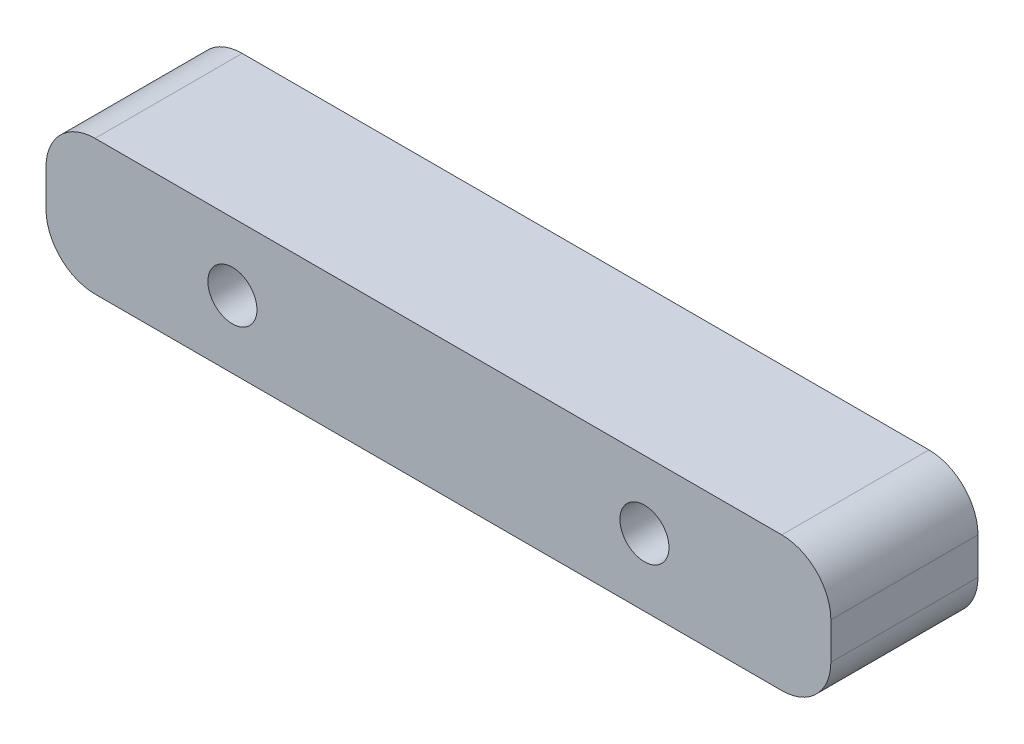
ISO-10303-21;
HEADER;
FILE_DESCRIPTION(('STEP AP214'),'2;1');
FILE_NAME('part.step','',(''),(''),'','','');
FILE_SCHEMA(('AUTOMOTIVE_DESIGN { 1 0 10303 214 1 1 1 1 }'));
ENDSEC;
DATA;
#1=APPLICATION_CONTEXT('core data for automotive mechanical design processes');
#2=APPLICATION_PROTOCOL_DEFINITION('international standard','automotive_design',2000,#1);
#3=PRODUCT_CONTEXT('',#1,'mechanical');
#4=PRODUCT('Part','Part','',(#3));
#5=PRODUCT_RELATED_PRODUCT_CATEGORY('part','',(#4));
#6=PRODUCT_DEFINITION_FORMATION('','',#4);
#7=PRODUCT_DEFINITION_CONTEXT('part definition',#1,'design');
#8=PRODUCT_DEFINITION('design','',#6,#7);
#9=PRODUCT_DEFINITION_SHAPE('','',#8);
#10=(LENGTH_UNIT() NAMED_UNIT(*) SI_UNIT(.MILLI.,.METRE.));
#11=(NAMED_UNIT(*) PLANE_ANGLE_UNIT() SI_UNIT($,.RADIAN.));
#12=(NAMED_UNIT(*) SI_UNIT($,.STERADIAN.) SOLID_ANGLE_UNIT());
#13=UNCERTAINTY_MEASURE_WITH_UNIT(LENGTH_MEASURE(1.E-05),#10,'distance_accuracy_value','');
#14=(GEOMETRIC_REPRESENTATION_CONTEXT(3) GLOBAL_UNCERTAINTY_ASSIGNED_CONTEXT((#13)) GLOBAL_UNIT_ASSIGNED_CONTEXT((#10,
#11,#12)) REPRESENTATION_CONTEXT('',''));
#15=CARTESIAN_POINT('',(0.,0.,0.));
#16=DIRECTION('',(0.,0.,1.));
#17=DIRECTION('',(1.,0.,0.));
#18=AXIS2_PLACEMENT_3D('',#15,#16,#17);
#19=CARTESIAN_POINT('',(35.,-1.875,15.));
#20=DIRECTION('',(0.,0.,-1.));
#21=DIRECTION('',(-1.,0.,0.));
#22=AXIS2_PLACEMENT_3D('',#19,#20,#21);
#23=CYLINDRICAL_SURFACE('',#22,4.99999999999999);
#24=CARTESIAN_POINT('',(35.,-1.875,0.));
#25=DIRECTION('',(0.,0.,1.));
#26=DIRECTION('',(1.,0.,0.));
#27=AXIS2_PLACEMENT_3D('',#24,#25,#26);
#28=CIRCLE('',#27,4.99999999999999);
#29=CARTESIAN_POINT('',(35.,-6.875,0.));
#30=VERTEX_POINT('',#29);
#31=CARTESIAN_POINT('',(40.,-1.875,0.));
#32=VERTEX_POINT('',#31);
#33=EDGE_CURVE('E139',#30,#32,#28,.T.);
#34=ORIENTED_EDGE('',*,*,#33,.T.);
#35=DIRECTION('',(0.,0.,-1.));
#36=VECTOR('',#35,1.);
#37=CARTESIAN_POINT('',(40.,-1.875,15.));
#38=LINE('',#37,#36);
#39=CARTESIAN_POINT('',(40.,-1.875,15.));
#40=VERTEX_POINT('',#39);
#41=EDGE_CURVE('E11',#40,#32,#38,.T.);
#42=ORIENTED_EDGE('',*,*,#41,.F.);
#43=CARTESIAN_POINT('',(35.,-1.875,15.));
#44=DIRECTION('',(0.,0.,1.));
#45=DIRECTION('',(1.,0.,0.));
#46=AXIS2_PLACEMENT_3D('',#43,#44,#45);
#47=CIRCLE('',#46,4.99999999999999);
#48=CARTESIAN_POINT('',(35.,-6.875,15.));
#49=VERTEX_POINT('',#48);
#50=EDGE_CURVE('E154',#49,#40,#47,.T.);
#51=ORIENTED_EDGE('',*,*,#50,.F.);
#52=DIRECTION('',(0.,0.,-1.));
#53=VECTOR('',#52,1.);
#54=CARTESIAN_POINT('',(35.,-6.875,15.));
#55=LINE('',#54,#53);
#56=EDGE_CURVE('E135',#49,#30,#55,.T.);
#57=ORIENTED_EDGE('',*,*,#56,.T.);
#58=EDGE_LOOP('',(#34,#42,#51,#57));
#59=FACE_BOUND('',#58,.T.);
#60=ADVANCED_FACE('F43',(#59),#23,.T.);
#61=CARTESIAN_POINT('',(40.,1.875,15.));
#62=DIRECTION('',(-1.,0.,0.));
#63=DIRECTION('',(0.,0.,1.));
#64=AXIS2_PLACEMENT_3D('',#61,#62,#63);
#65=PLANE('',#64);
#66=DIRECTION('',(0.,1.,0.));
#67=VECTOR('',#66,1.);
#68=CARTESIAN_POINT('',(40.,1.875,0.));
#69=LINE('',#68,#67);
#70=CARTESIAN_POINT('',(40.,1.875,0.));
#71=VERTEX_POINT('',#70);
#72=EDGE_CURVE('E142',#32,#71,#69,.T.);
#73=ORIENTED_EDGE('',*,*,#72,.T.);
#74=DIRECTION('',(0.,0.,-1.));
#75=VECTOR('',#74,1.);
#76=CARTESIAN_POINT('',(40.,1.875,15.));
#77=LINE('',#76,#75);
#78=CARTESIAN_POINT('',(40.,1.875,15.));
#79=VERTEX_POINT('',#78);
#80=EDGE_CURVE('E51',#79,#71,#77,.T.);
#81=ORIENTED_EDGE('',*,*,#80,.F.);
#82=DIRECTION('',(0.,1.,0.));
#83=VECTOR('',#82,1.);
#84=CARTESIAN_POINT('',(40.,1.875,15.));
#85=LINE('',#84,#83);
#86=EDGE_CURVE('E102',#40,#79,#85,.T.);
#87=ORIENTED_EDGE('',*,*,#86,.F.);
#88=ORIENTED_EDGE('',*,*,#41,.T.);
#89=EDGE_LOOP('',(#73,#81,#87,#88));
#90=FACE_BOUND('',#89,.T.);
#91=ADVANCED_FACE('F223',(#90),#65,.F.);
#92=CARTESIAN_POINT('',(35.,1.875,15.));
#93=DIRECTION('',(0.,0.,-1.));
#94=DIRECTION('',(-1.,0.,0.));
#95=AXIS2_PLACEMENT_3D('',#92,#93,#94);
#96=CYLINDRICAL_SURFACE('',#95,5.);
#97=CARTESIAN_POINT('',(35.,1.875,0.));
#98=DIRECTION('',(0.,0.,1.));
#99=DIRECTION('',(1.,0.,0.));
#100=AXIS2_PLACEMENT_3D('',#97,#98,#99);
#101=CIRCLE('',#100,5.);
#102=CARTESIAN_POINT('',(35.,6.875,0.));
#103=VERTEX_POINT('',#102);
#104=EDGE_CURVE('E145',#71,#103,#101,.T.);
#105=ORIENTED_EDGE('',*,*,#104,.T.);
#106=DIRECTION('',(0.,0.,-1.));
#107=VECTOR('',#106,1.);
#108=CARTESIAN_POINT('',(35.,6.875,15.));
#109=LINE('',#108,#107);
#110=CARTESIAN_POINT('',(35.,6.875,15.));
#111=VERTEX_POINT('',#110);
#112=EDGE_CURVE('E161',#111,#103,#109,.T.);
#113=ORIENTED_EDGE('',*,*,#112,.F.);
#114=CARTESIAN_POINT('',(35.,1.875,15.));
#115=DIRECTION('',(0.,0.,1.));
#116=DIRECTION('',(1.,0.,0.));
#117=AXIS2_PLACEMENT_3D('',#114,#115,#116);
#118=CIRCLE('',#117,5.);
#119=EDGE_CURVE('E169',#79,#111,#118,.T.);
#120=ORIENTED_EDGE('',*,*,#119,.F.);
#121=ORIENTED_EDGE('',*,*,#80,.T.);
#122=EDGE_LOOP('',(#105,#113,#120,#121));
#123=FACE_BOUND('',#122,.T.);
#124=ADVANCED_FACE('F167',(#123),#96,.T.);
#125=CARTESIAN_POINT('',(-35.,6.875,15.));
#126=DIRECTION('',(0.,-1.,0.));
#127=DIRECTION('',(0.,0.,-1.));
#128=AXIS2_PLACEMENT_3D('',#125,#126,#127);
#129=PLANE('',#128);
#130=DIRECTION('',(-1.,0.,0.));
#131=VECTOR('',#130,1.);
#132=CARTESIAN_POINT('',(-35.,6.875,0.));
#133=LINE('',#132,#131);
#134=CARTESIAN_POINT('',(-35.,6.875,0.));
#135=VERTEX_POINT('',#134);
#136=EDGE_CURVE('E147',#103,#135,#133,.T.);
#137=ORIENTED_EDGE('',*,*,#136,.T.);
#138=DIRECTION('',(0.,0.,-1.));
#139=VECTOR('',#138,1.);
#140=CARTESIAN_POINT('',(-35.,6.875,15.));
#141=LINE('',#140,#139);
#142=CARTESIAN_POINT('',(-35.,6.875,15.));
#143=VERTEX_POINT('',#142);
#144=EDGE_CURVE('E158',#143,#135,#141,.T.);
#145=ORIENTED_EDGE('',*,*,#144,.F.);
#146=DIRECTION('',(-1.,0.,0.));
#147=VECTOR('',#146,1.);
#148=CARTESIAN_POINT('',(-35.,6.875,15.));
#149=LINE('',#148,#147);
#150=EDGE_CURVE('E181',#111,#143,#149,.T.);
#151=ORIENTED_EDGE('',*,*,#150,.F.);
#152=ORIENTED_EDGE('',*,*,#112,.T.);
#153=EDGE_LOOP('',(#137,#145,#151,#152));
#154=FACE_BOUND('',#153,.T.);
#155=ADVANCED_FACE('F177',(#154),#129,.F.);
#156=CARTESIAN_POINT('',(-35.,1.875,15.));
#157=DIRECTION('',(0.,0.,-1.));
#158=DIRECTION('',(-1.,0.,0.));
#159=AXIS2_PLACEMENT_3D('',#156,#157,#158);
#160=CYLINDRICAL_SURFACE('',#159,5.);
#161=CARTESIAN_POINT('',(-35.,1.875,0.));
#162=DIRECTION('',(0.,0.,1.));
#163=DIRECTION('',(-1.,0.,0.));
#164=AXIS2_PLACEMENT_3D('',#161,#162,#163);
#165=CIRCLE('',#164,5.);
#166=CARTESIAN_POINT('',(-40.,1.875,0.));
#167=VERTEX_POINT('',#166);
#168=EDGE_CURVE('E149',#135,#167,#165,.T.);
#169=ORIENTED_EDGE('',*,*,#168,.T.);
#170=DIRECTION('',(0.,0.,-1.));
#171=VECTOR('',#170,1.);
#172=CARTESIAN_POINT('',(-40.,1.875,15.));
#173=LINE('',#172,#171);
#174=CARTESIAN_POINT('',(-40.,1.875,15.));
#175=VERTEX_POINT('',#174);
#176=EDGE_CURVE('E130',#175,#167,#173,.T.);
#177=ORIENTED_EDGE('',*,*,#176,.F.);
#178=CARTESIAN_POINT('',(-35.,1.875,15.));
#179=DIRECTION('',(0.,0.,1.));
#180=DIRECTION('',(-1.,0.,0.));
#181=AXIS2_PLACEMENT_3D('',#178,#179,#180);
#182=CIRCLE('',#181,5.);
#183=EDGE_CURVE('E121',#143,#175,#182,.T.);
#184=ORIENTED_EDGE('',*,*,#183,.F.);
#185=ORIENTED_EDGE('',*,*,#144,.T.);
#186=EDGE_LOOP('',(#169,#177,#184,#185));
#187=FACE_BOUND('',#186,.T.);
#188=ADVANCED_FACE('F180',(#187),#160,.T.);
#189=CARTESIAN_POINT('',(-40.,1.875,15.));
#190=DIRECTION('',(1.,0.,0.));
#191=DIRECTION('',(0.,0.,-1.));
#192=AXIS2_PLACEMENT_3D('',#189,#190,#191);
#193=PLANE('',#192);
#194=DIRECTION('',(0.,-1.,0.));
#195=VECTOR('',#194,1.);
#196=CARTESIAN_POINT('',(-40.,1.875,0.));
#197=LINE('',#196,#195);
#198=CARTESIAN_POINT('',(-40.,-1.875,0.));
#199=VERTEX_POINT('',#198);
#200=EDGE_CURVE('E129',#167,#199,#197,.T.);
#201=ORIENTED_EDGE('',*,*,#200,.T.);
#202=DIRECTION('',(0.,0.,-1.));
#203=VECTOR('',#202,1.);
#204=CARTESIAN_POINT('',(-40.,-1.875,15.));
#205=LINE('',#204,#203);
#206=CARTESIAN_POINT('',(-40.,-1.875,15.));
#207=VERTEX_POINT('',#206);
#208=EDGE_CURVE('E126',#207,#199,#205,.T.);
#209=ORIENTED_EDGE('',*,*,#208,.F.);
#210=DIRECTION('',(0.,-1.,0.));
#211=VECTOR('',#210,1.);
#212=CARTESIAN_POINT('',(-40.,1.875,15.));
#213=LINE('',#212,#211);
#214=EDGE_CURVE('E115',#175,#207,#213,.T.);
#215=ORIENTED_EDGE('',*,*,#214,.F.);
#216=ORIENTED_EDGE('',*,*,#176,.T.);
#217=EDGE_LOOP('',(#201,#209,#215,#216));
#218=FACE_BOUND('',#217,.T.);
#219=ADVANCED_FACE('F127',(#218),#193,.F.);
#220=CARTESIAN_POINT('',(-35.,-1.875,15.));
#221=DIRECTION('',(0.,0.,-1.));
#222=DIRECTION('',(-1.,0.,0.));
#223=AXIS2_PLACEMENT_3D('',#220,#221,#222);
#224=CYLINDRICAL_SURFACE('',#223,5.);
#225=CARTESIAN_POINT('',(-35.,-1.875,0.));
#226=DIRECTION('',(0.,0.,1.));
#227=DIRECTION('',(1.,0.,0.));
#228=AXIS2_PLACEMENT_3D('',#225,#226,#227);
#229=CIRCLE('',#228,5.);
#230=CARTESIAN_POINT('',(-35.,-6.875,0.));
#231=VERTEX_POINT('',#230);
#232=EDGE_CURVE('E88',#199,#231,#229,.T.);
#233=ORIENTED_EDGE('',*,*,#232,.T.);
#234=DIRECTION('',(0.,0.,-1.));
#235=VECTOR('',#234,1.);
#236=CARTESIAN_POINT('',(-35.,-6.875,15.));
#237=LINE('',#236,#235);
#238=CARTESIAN_POINT('',(-35.,-6.875,15.));
#239=VERTEX_POINT('',#238);
#240=EDGE_CURVE('E131',#239,#231,#237,.T.);
#241=ORIENTED_EDGE('',*,*,#240,.F.);
#242=CARTESIAN_POINT('',(-35.,-1.875,15.));
#243=DIRECTION('',(0.,0.,1.));
#244=DIRECTION('',(1.,0.,0.));
#245=AXIS2_PLACEMENT_3D('',#242,#243,#244);
#246=CIRCLE('',#245,5.);
#247=EDGE_CURVE('E119',#207,#239,#246,.T.);
#248=ORIENTED_EDGE('',*,*,#247,.F.);
#249=ORIENTED_EDGE('',*,*,#208,.T.);
#250=EDGE_LOOP('',(#233,#241,#248,#249));
#251=FACE_BOUND('',#250,.T.);
#252=ADVANCED_FACE('F133',(#251),#224,.T.);
#253=CARTESIAN_POINT('',(-35.,-6.875,15.));
#254=DIRECTION('',(0.,1.,0.));
#255=DIRECTION('',(0.,0.,1.));
#256=AXIS2_PLACEMENT_3D('',#253,#254,#255);
#257=PLANE('',#256);
#258=DIRECTION('',(1.,0.,0.));
#259=VECTOR('',#258,1.);
#260=CARTESIAN_POINT('',(-35.,-6.875,0.));
#261=LINE('',#260,#259);
#262=EDGE_CURVE('E94',#231,#30,#261,.T.);
#263=ORIENTED_EDGE('',*,*,#262,.T.);
#264=ORIENTED_EDGE('',*,*,#56,.F.);
#265=DIRECTION('',(1.,0.,0.));
#266=VECTOR('',#265,1.);
#267=CARTESIAN_POINT('',(-35.,-6.875,15.));
#268=LINE('',#267,#266);
#269=EDGE_CURVE('E59',#239,#49,#268,.T.);
#270=ORIENTED_EDGE('',*,*,#269,.F.);
#271=ORIENTED_EDGE('',*,*,#240,.T.);
#272=EDGE_LOOP('',(#263,#264,#270,#271));
#273=FACE_BOUND('',#272,.T.);
#274=ADVANCED_FACE('F210',(#273),#257,.F.);
#275=CARTESIAN_POINT('',(35.,-1.875,15.));
#276=DIRECTION('',(0.,0.,1.));
#277=DIRECTION('',(1.,0.,0.));
#278=AXIS2_PLACEMENT_3D('',#275,#276,#277);
#279=PLANE('',#278);
#280=CARTESIAN_POINT('',(-21.,0.,15.));
#281=DIRECTION('',(0.,0.,1.));
#282=DIRECTION('',(1.,0.,0.));
#283=AXIS2_PLACEMENT_3D('',#280,#281,#282);
#284=CIRCLE('',#283,2.5);
#285=CARTESIAN_POINT('',(-18.5,0.,15.));
#286=VERTEX_POINT('',#285);
#287=EDGE_CURVE('E193',#286,#286,#284,.T.);
#288=ORIENTED_EDGE('',*,*,#287,.F.);
#289=EDGE_LOOP('',(#288));
#290=FACE_BOUND('',#289,.T.);
#291=CARTESIAN_POINT('',(21.,0.,15.));
#292=DIRECTION('',(0.,0.,1.));
#293=DIRECTION('',(1.,0.,0.));
#294=AXIS2_PLACEMENT_3D('',#291,#292,#293);
#295=CIRCLE('',#294,2.5);
#296=CARTESIAN_POINT('',(23.5,0.,15.));
#297=VERTEX_POINT('',#296);
#298=EDGE_CURVE('E190',#297,#297,#295,.T.);
#299=ORIENTED_EDGE('',*,*,#298,.F.);
#300=EDGE_LOOP('',(#299));
#301=FACE_BOUND('',#300,.T.);
#302=ORIENTED_EDGE('',*,*,#50,.T.);
#303=ORIENTED_EDGE('',*,*,#86,.T.);
#304=ORIENTED_EDGE('',*,*,#119,.T.);
#305=ORIENTED_EDGE('',*,*,#150,.T.);
#306=ORIENTED_EDGE('',*,*,#183,.T.);
#307=ORIENTED_EDGE('',*,*,#214,.T.);
#308=ORIENTED_EDGE('',*,*,#247,.T.);
#309=ORIENTED_EDGE('',*,*,#269,.T.);
#310=EDGE_LOOP('',(#302,#303,#304,#305,#306,#307,#308,#309));
#311=FACE_BOUND('',#310,.T.);
#312=ADVANCED_FACE('F117',(#290,#301,#311),#279,.T.);
#313=CARTESIAN_POINT('',(35.,-1.875,0.));
#314=DIRECTION('',(0.,0.,1.));
#315=DIRECTION('',(1.,0.,0.));
#316=AXIS2_PLACEMENT_3D('',#313,#314,#315);
#317=PLANE('',#316);
#318=CARTESIAN_POINT('',(-21.,0.,0.));
#319=DIRECTION('',(0.,0.,1.));
#320=DIRECTION('',(1.,0.,0.));
#321=AXIS2_PLACEMENT_3D('',#318,#319,#320);
#322=CIRCLE('',#321,2.5);
#323=CARTESIAN_POINT('',(-18.5,0.,0.));
#324=VERTEX_POINT('',#323);
#325=EDGE_CURVE('E143',#324,#324,#322,.T.);
#326=ORIENTED_EDGE('',*,*,#325,.T.);
#327=EDGE_LOOP('',(#326));
#328=FACE_BOUND('',#327,.T.);
#329=CARTESIAN_POINT('',(21.,0.,0.));
#330=DIRECTION('',(0.,0.,1.));
#331=DIRECTION('',(1.,0.,0.));
#332=AXIS2_PLACEMENT_3D('',#329,#330,#331);
#333=CIRCLE('',#332,2.5);
#334=CARTESIAN_POINT('',(23.5,0.,0.));
#335=VERTEX_POINT('',#334);
#336=EDGE_CURVE('E187',#335,#335,#333,.T.);
#337=ORIENTED_EDGE('',*,*,#336,.T.);
#338=EDGE_LOOP('',(#337));
#339=FACE_BOUND('',#338,.T.);
#340=ORIENTED_EDGE('',*,*,#33,.F.);
#341=ORIENTED_EDGE('',*,*,#262,.F.);
#342=ORIENTED_EDGE('',*,*,#232,.F.);
#343=ORIENTED_EDGE('',*,*,#200,.F.);
#344=ORIENTED_EDGE('',*,*,#168,.F.);
#345=ORIENTED_EDGE('',*,*,#136,.F.);
#346=ORIENTED_EDGE('',*,*,#104,.F.);
#347=ORIENTED_EDGE('',*,*,#72,.F.);
#348=EDGE_LOOP('',(#340,#341,#342,#343,#344,#345,#346,#347));
#349=FACE_BOUND('',#348,.T.);
#350=ADVANCED_FACE('F173',(#328,#339,#349),#317,.F.);
#351=CARTESIAN_POINT('',(21.,0.,0.));
#352=DIRECTION('',(0.,0.,1.));
#353=DIRECTION('',(1.,0.,0.));
#354=AXIS2_PLACEMENT_3D('',#351,#352,#353);
#355=CYLINDRICAL_SURFACE('',#354,2.5);
#356=ORIENTED_EDGE('',*,*,#336,.F.);
#357=EDGE_LOOP('',(#356));
#358=FACE_BOUND('',#357,.T.);
#359=ORIENTED_EDGE('',*,*,#298,.T.);
#360=EDGE_LOOP('',(#359));
#361=FACE_BOUND('',#360,.T.);
#362=ADVANCED_FACE('F204',(#358,#361),#355,.F.);
#363=CARTESIAN_POINT('',(-21.,0.,0.));
#364=DIRECTION('',(0.,0.,1.));
#365=DIRECTION('',(1.,0.,0.));
#366=AXIS2_PLACEMENT_3D('',#363,#364,#365);
#367=CYLINDRICAL_SURFACE('',#366,2.5);
#368=ORIENTED_EDGE('',*,*,#325,.F.);
#369=EDGE_LOOP('',(#368));
#370=FACE_BOUND('',#369,.T.);
#371=ORIENTED_EDGE('',*,*,#287,.T.);
#372=EDGE_LOOP('',(#371));
#373=FACE_BOUND('',#372,.T.);
#374=ADVANCED_FACE('F201',(#370,#373),#367,.F.);
#375=CLOSED_SHELL('',(#60,#91,#124,#155,#188,#219,#252,#274,#312,#350,#362,#374));
#376=MANIFOLD_SOLID_BREP('B2',#375);
#377=ADVANCED_BREP_SHAPE_REPRESENTATION('',(#18,#376),#14);
#378=SHAPE_DEFINITION_REPRESENTATION(#9,#377);
ENDSEC;
END-ISO-10303-21;
